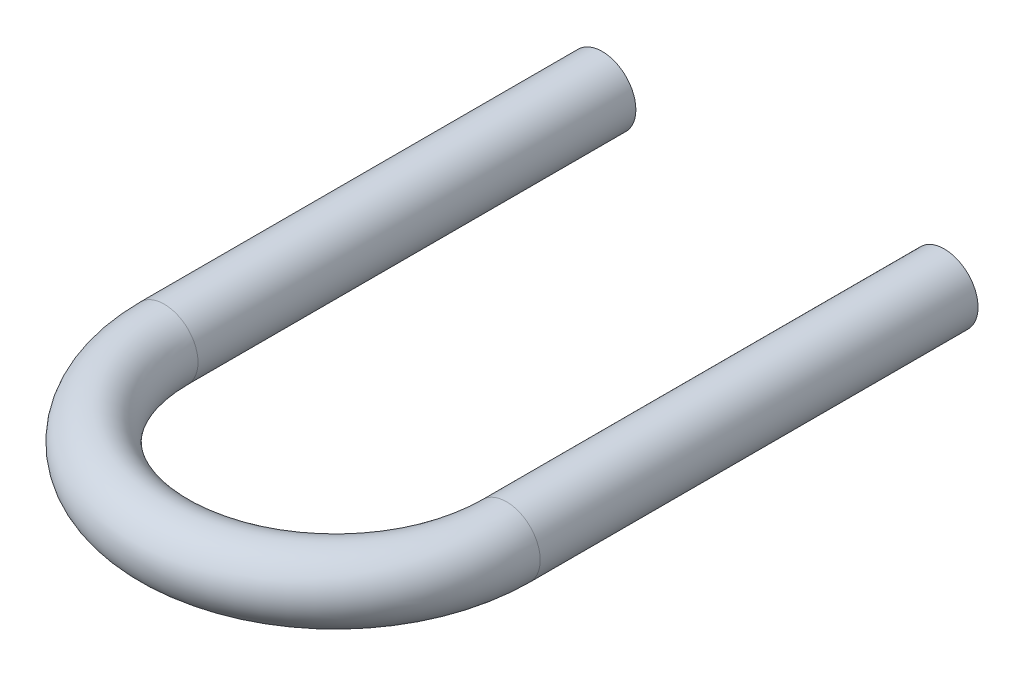
ISO-10303-21;
HEADER;
FILE_DESCRIPTION(('STEP AP214'),'2;1');
FILE_NAME('part.step','',(''),(''),'','','');
FILE_SCHEMA(('AUTOMOTIVE_DESIGN { 1 0 10303 214 1 1 1 1 }'));
ENDSEC;
DATA;
#1=APPLICATION_CONTEXT('core data for automotive mechanical design processes');
#2=APPLICATION_PROTOCOL_DEFINITION('international standard','automotive_design',2000,#1);
#3=PRODUCT_CONTEXT('',#1,'mechanical');
#4=PRODUCT('Part','Part','',(#3));
#5=PRODUCT_RELATED_PRODUCT_CATEGORY('part','',(#4));
#6=PRODUCT_DEFINITION_FORMATION('','',#4);
#7=PRODUCT_DEFINITION_CONTEXT('part definition',#1,'design');
#8=PRODUCT_DEFINITION('design','',#6,#7);
#9=PRODUCT_DEFINITION_SHAPE('','',#8);
#10=(LENGTH_UNIT() NAMED_UNIT(*) SI_UNIT(.MILLI.,.METRE.));
#11=(NAMED_UNIT(*) PLANE_ANGLE_UNIT() SI_UNIT($,.RADIAN.));
#12=(NAMED_UNIT(*) SI_UNIT($,.STERADIAN.) SOLID_ANGLE_UNIT());
#13=UNCERTAINTY_MEASURE_WITH_UNIT(LENGTH_MEASURE(1.E-05),#10,'distance_accuracy_value','');
#14=(GEOMETRIC_REPRESENTATION_CONTEXT(3) GLOBAL_UNCERTAINTY_ASSIGNED_CONTEXT((#13)) GLOBAL_UNIT_ASSIGNED_CONTEXT((#10,
#11,#12)) REPRESENTATION_CONTEXT('',''));
#15=CARTESIAN_POINT('',(0.,0.,0.));
#16=DIRECTION('',(0.,0.,1.));
#17=DIRECTION('',(1.,0.,0.));
#18=AXIS2_PLACEMENT_3D('',#15,#16,#17);
#19=CARTESIAN_POINT('',(2.54,0.,-3.));
#20=DIRECTION('',(0.,0.,-1.));
#21=DIRECTION('',(0.,-1.,0.));
#22=AXIS2_PLACEMENT_3D('',#19,#20,#21);
#23=PLANE('',#22);
#24=CARTESIAN_POINT('',(2.54,0.,-3.));
#25=DIRECTION('',(0.,0.,-1.));
#26=DIRECTION('',(-1.,0.,0.));
#27=AXIS2_PLACEMENT_3D('',#24,#25,#26);
#28=CIRCLE('',#27,0.25);
#29=CARTESIAN_POINT('',(2.29,0.,-3.));
#30=VERTEX_POINT('',#29);
#31=EDGE_CURVE('E11',#30,#30,#28,.T.);
#32=ORIENTED_EDGE('',*,*,#31,.T.);
#33=EDGE_LOOP('',(#32));
#34=FACE_BOUND('',#33,.T.);
#35=ADVANCED_FACE('F16',(#34),#23,.T.);
#36=CARTESIAN_POINT('',(2.54,0.,0.25));
#37=DIRECTION('',(0.,0.,-1.));
#38=DIRECTION('',(-1.,0.,0.));
#39=AXIS2_PLACEMENT_3D('',#36,#37,#38);
#40=CYLINDRICAL_SURFACE('',#39,0.25);
#41=DIRECTION('',(0.,0.,-1.));
#42=VECTOR('',#41,1.);
#43=CARTESIAN_POINT('',(2.29,0.,0.25));
#44=LINE('',#43,#42);
#45=CARTESIAN_POINT('',(2.29,0.,0.25));
#46=VERTEX_POINT('',#45);
#47=EDGE_CURVE('E20',#46,#30,#44,.T.);
#48=ORIENTED_EDGE('',*,*,#47,.T.);
#49=ORIENTED_EDGE('',*,*,#31,.F.);
#50=ORIENTED_EDGE('',*,*,#47,.F.);
#51=CARTESIAN_POINT('',(2.54,0.,0.25));
#52=DIRECTION('',(0.,0.,1.));
#53=DIRECTION('',(1.,0.,0.));
#54=AXIS2_PLACEMENT_3D('',#51,#52,#53);
#55=CIRCLE('',#54,0.25);
#56=EDGE_CURVE('E69',#46,#46,#55,.T.);
#57=ORIENTED_EDGE('',*,*,#56,.F.);
#58=EDGE_LOOP('',(#48,#49,#50,#57));
#59=FACE_BOUND('',#58,.T.);
#60=ADVANCED_FACE('F78',(#59),#40,.T.);
#61=CARTESIAN_POINT('',(1.27,0.,0.25));
#62=DIRECTION('',(0.,1.,0.));
#63=DIRECTION('',(1.,0.,0.));
#64=AXIS2_PLACEMENT_3D('',#61,#62,#63);
#65=TOROIDAL_SURFACE('',#64,1.27,0.25);
#66=CARTESIAN_POINT('',(1.27,0.,0.25));
#67=DIRECTION('',(0.,1.,0.));
#68=DIRECTION('',(1.,0.,0.));
#69=AXIS2_PLACEMENT_3D('',#66,#67,#68);
#70=CIRCLE('',#69,1.02);
#71=CARTESIAN_POINT('',(0.25,0.,0.25));
#72=VERTEX_POINT('',#71);
#73=EDGE_CURVE('E47',#72,#46,#70,.T.);
#74=ORIENTED_EDGE('',*,*,#73,.T.);
#75=ORIENTED_EDGE('',*,*,#56,.T.);
#76=ORIENTED_EDGE('',*,*,#73,.F.);
#77=CARTESIAN_POINT('',(0.,0.,0.25));
#78=DIRECTION('',(0.,0.,1.));
#79=DIRECTION('',(1.,0.,0.));
#80=AXIS2_PLACEMENT_3D('',#77,#78,#79);
#81=CIRCLE('',#80,0.25);
#82=EDGE_CURVE('E59',#72,#72,#81,.T.);
#83=ORIENTED_EDGE('',*,*,#82,.T.);
#84=EDGE_LOOP('',(#74,#75,#76,#83));
#85=FACE_BOUND('',#84,.T.);
#86=ADVANCED_FACE('F18',(#85),#65,.T.);
#87=CARTESIAN_POINT('',(0.,0.,-3.));
#88=DIRECTION('',(0.,0.,1.));
#89=DIRECTION('',(1.,0.,0.));
#90=AXIS2_PLACEMENT_3D('',#87,#88,#89);
#91=CYLINDRICAL_SURFACE('',#90,0.25);
#92=DIRECTION('',(0.,0.,1.));
#93=VECTOR('',#92,1.);
#94=CARTESIAN_POINT('',(0.25,0.,-3.));
#95=LINE('',#94,#93);
#96=CARTESIAN_POINT('',(0.25,0.,-3.));
#97=VERTEX_POINT('',#96);
#98=EDGE_CURVE('E55',#97,#72,#95,.T.);
#99=ORIENTED_EDGE('',*,*,#98,.T.);
#100=ORIENTED_EDGE('',*,*,#82,.F.);
#101=ORIENTED_EDGE('',*,*,#98,.F.);
#102=CARTESIAN_POINT('',(0.,0.,-3.));
#103=DIRECTION('',(0.,0.,1.));
#104=DIRECTION('',(1.,0.,0.));
#105=AXIS2_PLACEMENT_3D('',#102,#103,#104);
#106=CIRCLE('',#105,0.25);
#107=EDGE_CURVE('E58',#97,#97,#106,.T.);
#108=ORIENTED_EDGE('',*,*,#107,.T.);
#109=EDGE_LOOP('',(#99,#100,#101,#108));
#110=FACE_BOUND('',#109,.T.);
#111=ADVANCED_FACE('F56',(#110),#91,.T.);
#112=CARTESIAN_POINT('',(0.,0.,-3.));
#113=DIRECTION('',(0.,0.,1.));
#114=DIRECTION('',(1.,0.,0.));
#115=AXIS2_PLACEMENT_3D('',#112,#113,#114);
#116=PLANE('',#115);
#117=ORIENTED_EDGE('',*,*,#107,.F.);
#118=EDGE_LOOP('',(#117));
#119=FACE_BOUND('',#118,.T.);
#120=ADVANCED_FACE('F102',(#119),#116,.F.);
#121=CLOSED_SHELL('',(#35,#60,#86,#111,#120));
#122=MANIFOLD_SOLID_BREP('B1',#121);
#123=ADVANCED_BREP_SHAPE_REPRESENTATION('',(#18,#122),#14);
#124=SHAPE_DEFINITION_REPRESENTATION(#9,#123);
ENDSEC;
END-ISO-10303-21;
